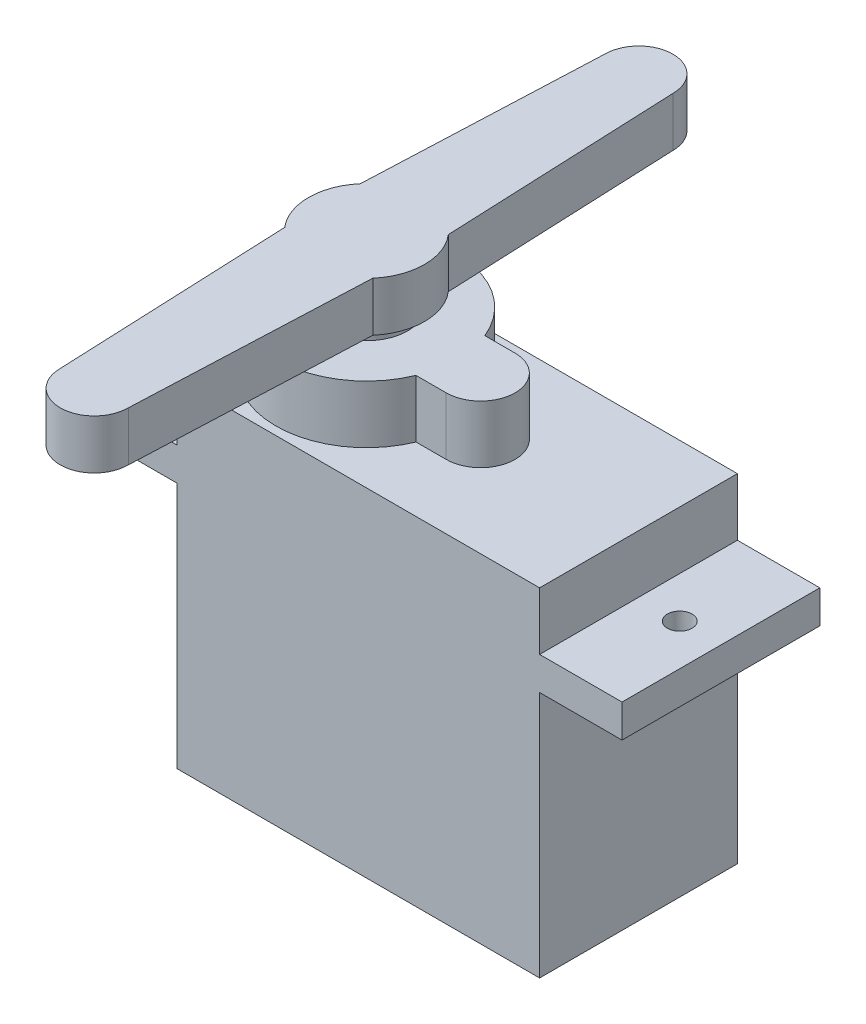
ISO-10303-21;
HEADER;
FILE_DESCRIPTION(('STEP AP214'),'2;1');
FILE_NAME('part.step','',(''),(''),'','','');
FILE_SCHEMA(('AUTOMOTIVE_DESIGN { 1 0 10303 214 1 1 1 1 }'));
ENDSEC;
DATA;
#1=APPLICATION_CONTEXT('core data for automotive mechanical design processes');
#2=APPLICATION_PROTOCOL_DEFINITION('international standard','automotive_design',2000,#1);
#3=PRODUCT_CONTEXT('',#1,'mechanical');
#4=PRODUCT('Part','Part','',(#3));
#5=PRODUCT_RELATED_PRODUCT_CATEGORY('part','',(#4));
#6=PRODUCT_DEFINITION_FORMATION('','',#4);
#7=PRODUCT_DEFINITION_CONTEXT('part definition',#1,'design');
#8=PRODUCT_DEFINITION('design','',#6,#7);
#9=PRODUCT_DEFINITION_SHAPE('','',#8);
#10=(LENGTH_UNIT() NAMED_UNIT(*) SI_UNIT(.MILLI.,.METRE.));
#11=(NAMED_UNIT(*) PLANE_ANGLE_UNIT() SI_UNIT($,.RADIAN.));
#12=(NAMED_UNIT(*) SI_UNIT($,.STERADIAN.) SOLID_ANGLE_UNIT());
#13=UNCERTAINTY_MEASURE_WITH_UNIT(LENGTH_MEASURE(1.E-05),#10,'distance_accuracy_value','');
#14=(GEOMETRIC_REPRESENTATION_CONTEXT(3) GLOBAL_UNCERTAINTY_ASSIGNED_CONTEXT((#13)) GLOBAL_UNIT_ASSIGNED_CONTEXT((#10,
#11,#12)) REPRESENTATION_CONTEXT('',''));
#15=CARTESIAN_POINT('',(0.,0.,0.));
#16=DIRECTION('',(0.,0.,1.));
#17=DIRECTION('',(1.,0.,0.));
#18=AXIS2_PLACEMENT_3D('',#15,#16,#17);
#19=CARTESIAN_POINT('',(-5.5,18.0282679432593,0.0471153363510377));
#20=DIRECTION('',(0.,-1.,0.));
#21=DIRECTION('',(0.,0.,-1.));
#22=AXIS2_PLACEMENT_3D('',#19,#20,#21);
#23=CYLINDRICAL_SURFACE('',#22,2.5);
#24=CARTESIAN_POINT('',(-5.5,15.0282679432593,0.0471153363510377));
#25=DIRECTION('',(0.,1.,0.));
#26=DIRECTION('',(0.,0.,1.));
#27=AXIS2_PLACEMENT_3D('',#24,#25,#26);
#28=CIRCLE('',#27,2.5);
#29=CARTESIAN_POINT('',(-5.5,15.0282679432593,2.54711533635104));
#30=VERTEX_POINT('',#29);
#31=EDGE_CURVE('E88',#30,#30,#28,.T.);
#32=ORIENTED_EDGE('',*,*,#31,.T.);
#33=EDGE_LOOP('',(#32));
#34=FACE_BOUND('',#33,.T.);
#35=CARTESIAN_POINT('',(-5.5,16.0282679432593,0.0471153363510377));
#36=DIRECTION('',(0.,1.,0.));
#37=DIRECTION('',(0.,0.,1.));
#38=AXIS2_PLACEMENT_3D('',#35,#36,#37);
#39=CIRCLE('',#38,2.5);
#40=CARTESIAN_POINT('',(-5.5,16.0282679432593,2.54711533635104));
#41=VERTEX_POINT('',#40);
#42=EDGE_CURVE('E12',#41,#41,#39,.T.);
#43=ORIENTED_EDGE('',*,*,#42,.F.);
#44=EDGE_LOOP('',(#43));
#45=FACE_BOUND('',#44,.T.);
#46=ADVANCED_FACE('F79',(#34,#45),#23,.T.);
#47=CARTESIAN_POINT('',(0.,8.02826794325932,-40.27612723124));
#48=DIRECTION('',(0.,-1.,0.));
#49=DIRECTION('',(0.,0.,-1.));
#50=AXIS2_PLACEMENT_3D('',#47,#48,#49);
#51=PLANE('',#50);
#52=CARTESIAN_POINT('',(-13.5,8.02826794325932,0.0471153363510377));
#53=DIRECTION('',(0.,1.,0.));
#54=DIRECTION('',(0.,0.,1.));
#55=AXIS2_PLACEMENT_3D('',#52,#53,#54);
#56=CIRCLE('',#55,0.75);
#57=CARTESIAN_POINT('',(-13.5,8.02826794325932,0.797115336351038));
#58=VERTEX_POINT('',#57);
#59=EDGE_CURVE('E442',#58,#58,#56,.T.);
#60=ORIENTED_EDGE('',*,*,#59,.F.);
#61=EDGE_LOOP('',(#60));
#62=FACE_BOUND('',#61,.T.);
#63=DIRECTION('',(0.,0.,1.));
#64=VECTOR('',#63,1.);
#65=CARTESIAN_POINT('',(-11.,8.02826794325932,-5.95288466364896));
#66=LINE('',#65,#64);
#67=CARTESIAN_POINT('',(-11.,8.02826794325932,-5.95288466364896));
#68=VERTEX_POINT('',#67);
#69=CARTESIAN_POINT('',(-11.,8.02826794325932,6.04711533635104));
#70=VERTEX_POINT('',#69);
#71=EDGE_CURVE('E354',#68,#70,#66,.T.);
#72=ORIENTED_EDGE('',*,*,#71,.F.);
#73=DIRECTION('',(-1.,0.,0.));
#74=VECTOR('',#73,1.);
#75=CARTESIAN_POINT('',(-11.,8.02826794325932,-5.95288466364896));
#76=LINE('',#75,#74);
#77=CARTESIAN_POINT('',(-16.,8.02826794325932,-5.95288466364896));
#78=VERTEX_POINT('',#77);
#79=EDGE_CURVE('E385',#68,#78,#76,.T.);
#80=ORIENTED_EDGE('',*,*,#79,.T.);
#81=DIRECTION('',(0.,0.,1.));
#82=VECTOR('',#81,1.);
#83=CARTESIAN_POINT('',(-16.,8.02826794325932,-5.95288466364896));
#84=LINE('',#83,#82);
#85=CARTESIAN_POINT('',(-16.,8.02826794325932,6.04711533635104));
#86=VERTEX_POINT('',#85);
#87=EDGE_CURVE('E384',#78,#86,#84,.T.);
#88=ORIENTED_EDGE('',*,*,#87,.T.);
#89=DIRECTION('',(1.,0.,0.));
#90=VECTOR('',#89,1.);
#91=CARTESIAN_POINT('',(-11.,8.02826794325932,6.04711533635104));
#92=LINE('',#91,#90);
#93=EDGE_CURVE('E388',#86,#70,#92,.T.);
#94=ORIENTED_EDGE('',*,*,#93,.T.);
#95=EDGE_LOOP('',(#72,#80,#88,#94));
#96=FACE_BOUND('',#95,.T.);
#97=ADVANCED_FACE('F456',(#62,#96),#51,.F.);
#98=CARTESIAN_POINT('',(13.5,8.02826794325932,0.0471153363510377));
#99=DIRECTION('',(0.,1.,0.));
#100=DIRECTION('',(0.,0.,1.));
#101=AXIS2_PLACEMENT_3D('',#98,#99,#100);
#102=CIRCLE('',#101,0.75);
#103=CARTESIAN_POINT('',(13.5,8.02826794325932,0.797115336351038));
#104=VERTEX_POINT('',#103);
#105=EDGE_CURVE('E274',#104,#104,#102,.T.);
#106=ORIENTED_EDGE('',*,*,#105,.F.);
#107=EDGE_LOOP('',(#106));
#108=FACE_BOUND('',#107,.T.);
#109=DIRECTION('',(0.,0.,-1.));
#110=VECTOR('',#109,1.);
#111=CARTESIAN_POINT('',(11.,8.02826794325932,-5.95288466364896));
#112=LINE('',#111,#110);
#113=CARTESIAN_POINT('',(11.,8.02826794325932,6.04711533635104));
#114=VERTEX_POINT('',#113);
#115=CARTESIAN_POINT('',(11.,8.02826794325932,-5.95288466364896));
#116=VERTEX_POINT('',#115);
#117=EDGE_CURVE('E367',#114,#116,#112,.T.);
#118=ORIENTED_EDGE('',*,*,#117,.F.);
#119=CARTESIAN_POINT('',(16.,8.02826794325932,6.04711533635104));
#120=VERTEX_POINT('',#119);
#121=EDGE_CURVE('E387',#114,#120,#92,.T.);
#122=ORIENTED_EDGE('',*,*,#121,.T.);
#123=DIRECTION('',(0.,0.,-1.));
#124=VECTOR('',#123,1.);
#125=CARTESIAN_POINT('',(16.,8.02826794325932,-5.95288466364896));
#126=LINE('',#125,#124);
#127=CARTESIAN_POINT('',(16.,8.02826794325932,-5.95288466364896));
#128=VERTEX_POINT('',#127);
#129=EDGE_CURVE('E390',#120,#128,#126,.T.);
#130=ORIENTED_EDGE('',*,*,#129,.T.);
#131=EDGE_CURVE('E382',#128,#116,#76,.T.);
#132=ORIENTED_EDGE('',*,*,#131,.T.);
#133=EDGE_LOOP('',(#118,#122,#130,#132));
#134=FACE_BOUND('',#133,.T.);
#135=ADVANCED_FACE('F453',(#108,#134),#51,.F.);
#136=CARTESIAN_POINT('',(-11.,-8.97173205674068,-5.95288466364896));
#137=DIRECTION('',(-1.,0.,0.));
#138=DIRECTION('',(0.,0.,1.));
#139=AXIS2_PLACEMENT_3D('',#136,#137,#138);
#140=PLANE('',#139);
#141=DIRECTION('',(0.,0.,1.));
#142=VECTOR('',#141,1.);
#143=CARTESIAN_POINT('',(-11.,6.02826794325932,-5.95288466364896));
#144=LINE('',#143,#142);
#145=CARTESIAN_POINT('',(-11.,6.02826794325932,-5.95288466364896));
#146=VERTEX_POINT('',#145);
#147=CARTESIAN_POINT('',(-11.,6.02826794325932,6.04711533635104));
#148=VERTEX_POINT('',#147);
#149=EDGE_CURVE('E417',#146,#148,#144,.T.);
#150=ORIENTED_EDGE('',*,*,#149,.F.);
#151=DIRECTION('',(0.,1.,0.));
#152=VECTOR('',#151,1.);
#153=CARTESIAN_POINT('',(-11.,-8.97173205674068,-5.95288466364896));
#154=LINE('',#153,#152);
#155=CARTESIAN_POINT('',(-11.,-8.97173205674068,-5.95288466364896));
#156=VERTEX_POINT('',#155);
#157=EDGE_CURVE('E435',#156,#146,#154,.T.);
#158=ORIENTED_EDGE('',*,*,#157,.F.);
#159=DIRECTION('',(0.,0.,1.));
#160=VECTOR('',#159,1.);
#161=CARTESIAN_POINT('',(-11.,-8.97173205674068,-5.95288466364896));
#162=LINE('',#161,#160);
#163=CARTESIAN_POINT('',(-11.,-8.97173205674068,6.04711533635104));
#164=VERTEX_POINT('',#163);
#165=EDGE_CURVE('E418',#156,#164,#162,.T.);
#166=ORIENTED_EDGE('',*,*,#165,.T.);
#167=DIRECTION('',(0.,1.,0.));
#168=VECTOR('',#167,1.);
#169=CARTESIAN_POINT('',(-11.,-8.97173205674068,6.04711533635104));
#170=LINE('',#169,#168);
#171=EDGE_CURVE('E430',#164,#148,#170,.T.);
#172=ORIENTED_EDGE('',*,*,#171,.T.);
#173=EDGE_LOOP('',(#150,#158,#166,#172));
#174=FACE_BOUND('',#173,.T.);
#175=ADVANCED_FACE('F81',(#174),#140,.T.);
#176=CARTESIAN_POINT('',(-11.,-8.97173205674068,-5.95288466364896));
#177=DIRECTION('',(0.,0.,1.));
#178=DIRECTION('',(1.,0.,0.));
#179=AXIS2_PLACEMENT_3D('',#176,#177,#178);
#180=PLANE('',#179);
#181=ORIENTED_EDGE('',*,*,#157,.T.);
#182=DIRECTION('',(-1.,0.,0.));
#183=VECTOR('',#182,1.);
#184=CARTESIAN_POINT('',(11.,6.02826794325932,-5.95288466364896));
#185=LINE('',#184,#183);
#186=CARTESIAN_POINT('',(-16.,6.02826794325932,-5.95288466364896));
#187=VERTEX_POINT('',#186);
#188=EDGE_CURVE('E402',#146,#187,#185,.T.);
#189=ORIENTED_EDGE('',*,*,#188,.T.);
#190=DIRECTION('',(0.,-1.,0.));
#191=VECTOR('',#190,1.);
#192=CARTESIAN_POINT('',(-16.,8.02826794325932,-5.95288466364896));
#193=LINE('',#192,#191);
#194=EDGE_CURVE('E414',#78,#187,#193,.T.);
#195=ORIENTED_EDGE('',*,*,#194,.F.);
#196=ORIENTED_EDGE('',*,*,#79,.F.);
#197=DIRECTION('',(0.,-1.,0.));
#198=VECTOR('',#197,1.);
#199=CARTESIAN_POINT('',(-11.,11.5282679432593,-5.95288466364896));
#200=LINE('',#199,#198);
#201=CARTESIAN_POINT('',(-11.,11.5282679432593,-5.95288466364896));
#202=VERTEX_POINT('',#201);
#203=EDGE_CURVE('E364',#202,#68,#200,.T.);
#204=ORIENTED_EDGE('',*,*,#203,.F.);
#205=DIRECTION('',(-1.,0.,0.));
#206=VECTOR('',#205,1.);
#207=CARTESIAN_POINT('',(-11.,11.5282679432593,-5.95288466364896));
#208=LINE('',#207,#206);
#209=CARTESIAN_POINT('',(11.,11.5282679432593,-5.95288466364896));
#210=VERTEX_POINT('',#209);
#211=EDGE_CURVE('E362',#210,#202,#208,.T.);
#212=ORIENTED_EDGE('',*,*,#211,.F.);
#213=DIRECTION('',(0.,-1.,0.));
#214=VECTOR('',#213,1.);
#215=CARTESIAN_POINT('',(11.,11.5282679432593,-5.95288466364896));
#216=LINE('',#215,#214);
#217=EDGE_CURVE('E372',#210,#116,#216,.T.);
#218=ORIENTED_EDGE('',*,*,#217,.T.);
#219=ORIENTED_EDGE('',*,*,#131,.F.);
#220=DIRECTION('',(0.,-1.,0.));
#221=VECTOR('',#220,1.);
#222=CARTESIAN_POINT('',(16.,8.02826794325932,-5.95288466364896));
#223=LINE('',#222,#221);
#224=CARTESIAN_POINT('',(16.,6.02826794325932,-5.95288466364896));
#225=VERTEX_POINT('',#224);
#226=EDGE_CURVE('E393',#128,#225,#223,.T.);
#227=ORIENTED_EDGE('',*,*,#226,.T.);
#228=CARTESIAN_POINT('',(11.,6.02826794325932,-5.95288466364896));
#229=VERTEX_POINT('',#228);
#230=EDGE_CURVE('E403',#225,#229,#185,.T.);
#231=ORIENTED_EDGE('',*,*,#230,.T.);
#232=DIRECTION('',(0.,1.,0.));
#233=VECTOR('',#232,1.);
#234=CARTESIAN_POINT('',(11.,-8.97173205674068,-5.95288466364896));
#235=LINE('',#234,#233);
#236=CARTESIAN_POINT('',(11.,-8.97173205674068,-5.95288466364896));
#237=VERTEX_POINT('',#236);
#238=EDGE_CURVE('E437',#237,#229,#235,.T.);
#239=ORIENTED_EDGE('',*,*,#238,.F.);
#240=DIRECTION('',(1.,0.,0.));
#241=VECTOR('',#240,1.);
#242=CARTESIAN_POINT('',(-11.,-8.97173205674068,-5.95288466364896));
#243=LINE('',#242,#241);
#244=EDGE_CURVE('E428',#156,#237,#243,.T.);
#245=ORIENTED_EDGE('',*,*,#244,.F.);
#246=EDGE_LOOP('',(#181,#189,#195,#196,#204,#212,#218,#219,#227,#231,#239,#245));
#247=FACE_BOUND('',#246,.T.);
#248=ADVANCED_FACE('F482',(#247),#180,.F.);
#249=CARTESIAN_POINT('',(11.,-8.97173205674068,6.04711533635104));
#250=DIRECTION('',(1.,0.,0.));
#251=DIRECTION('',(0.,0.,-1.));
#252=AXIS2_PLACEMENT_3D('',#249,#250,#251);
#253=PLANE('',#252);
#254=DIRECTION('',(0.,0.,-1.));
#255=VECTOR('',#254,1.);
#256=CARTESIAN_POINT('',(11.,6.02826794325932,6.04711533635104));
#257=LINE('',#256,#255);
#258=CARTESIAN_POINT('',(11.,6.02826794325932,6.04711533635104));
#259=VERTEX_POINT('',#258);
#260=EDGE_CURVE('E422',#259,#229,#257,.T.);
#261=ORIENTED_EDGE('',*,*,#260,.F.);
#262=DIRECTION('',(0.,1.,0.));
#263=VECTOR('',#262,1.);
#264=CARTESIAN_POINT('',(11.,-8.97173205674068,6.04711533635104));
#265=LINE('',#264,#263);
#266=CARTESIAN_POINT('',(11.,-8.97173205674068,6.04711533635104));
#267=VERTEX_POINT('',#266);
#268=EDGE_CURVE('E439',#267,#259,#265,.T.);
#269=ORIENTED_EDGE('',*,*,#268,.F.);
#270=DIRECTION('',(0.,0.,-1.));
#271=VECTOR('',#270,1.);
#272=CARTESIAN_POINT('',(11.,-8.97173205674068,6.04711533635104));
#273=LINE('',#272,#271);
#274=EDGE_CURVE('E425',#267,#237,#273,.T.);
#275=ORIENTED_EDGE('',*,*,#274,.T.);
#276=ORIENTED_EDGE('',*,*,#238,.T.);
#277=EDGE_LOOP('',(#261,#269,#275,#276));
#278=FACE_BOUND('',#277,.T.);
#279=ADVANCED_FACE('F503',(#278),#253,.T.);
#280=CARTESIAN_POINT('',(-11.,-8.97173205674068,6.04711533635104));
#281=DIRECTION('',(0.,0.,1.));
#282=DIRECTION('',(1.,0.,0.));
#283=AXIS2_PLACEMENT_3D('',#280,#281,#282);
#284=PLANE('',#283);
#285=ORIENTED_EDGE('',*,*,#268,.T.);
#286=DIRECTION('',(1.,0.,0.));
#287=VECTOR('',#286,1.);
#288=CARTESIAN_POINT('',(11.,6.02826794325932,6.04711533635104));
#289=LINE('',#288,#287);
#290=CARTESIAN_POINT('',(16.,6.02826794325932,6.04711533635104));
#291=VERTEX_POINT('',#290);
#292=EDGE_CURVE('E396',#259,#291,#289,.T.);
#293=ORIENTED_EDGE('',*,*,#292,.T.);
#294=DIRECTION('',(0.,-1.,0.));
#295=VECTOR('',#294,1.);
#296=CARTESIAN_POINT('',(16.,8.02826794325932,6.04711533635104));
#297=LINE('',#296,#295);
#298=EDGE_CURVE('E408',#120,#291,#297,.T.);
#299=ORIENTED_EDGE('',*,*,#298,.F.);
#300=ORIENTED_EDGE('',*,*,#121,.F.);
#301=DIRECTION('',(0.,-1.,0.));
#302=VECTOR('',#301,1.);
#303=CARTESIAN_POINT('',(11.,11.5282679432593,6.04711533635104));
#304=LINE('',#303,#302);
#305=CARTESIAN_POINT('',(11.,11.5282679432593,6.04711533635104));
#306=VERTEX_POINT('',#305);
#307=EDGE_CURVE('E375',#306,#114,#304,.T.);
#308=ORIENTED_EDGE('',*,*,#307,.F.);
#309=DIRECTION('',(1.,0.,0.));
#310=VECTOR('',#309,1.);
#311=CARTESIAN_POINT('',(-11.,11.5282679432593,6.04711533635104));
#312=LINE('',#311,#310);
#313=CARTESIAN_POINT('',(-11.,11.5282679432593,6.04711533635104));
#314=VERTEX_POINT('',#313);
#315=EDGE_CURVE('E357',#314,#306,#312,.T.);
#316=ORIENTED_EDGE('',*,*,#315,.F.);
#317=DIRECTION('',(0.,-1.,0.));
#318=VECTOR('',#317,1.);
#319=CARTESIAN_POINT('',(-11.,11.5282679432593,6.04711533635104));
#320=LINE('',#319,#318);
#321=EDGE_CURVE('E378',#314,#70,#320,.T.);
#322=ORIENTED_EDGE('',*,*,#321,.T.);
#323=ORIENTED_EDGE('',*,*,#93,.F.);
#324=DIRECTION('',(0.,-1.,0.));
#325=VECTOR('',#324,1.);
#326=CARTESIAN_POINT('',(-16.,8.02826794325932,6.04711533635104));
#327=LINE('',#326,#325);
#328=CARTESIAN_POINT('',(-16.,6.02826794325932,6.04711533635104));
#329=VERTEX_POINT('',#328);
#330=EDGE_CURVE('E411',#86,#329,#327,.T.);
#331=ORIENTED_EDGE('',*,*,#330,.T.);
#332=EDGE_CURVE('E397',#329,#148,#289,.T.);
#333=ORIENTED_EDGE('',*,*,#332,.T.);
#334=ORIENTED_EDGE('',*,*,#171,.F.);
#335=DIRECTION('',(1.,0.,0.));
#336=VECTOR('',#335,1.);
#337=CARTESIAN_POINT('',(-11.,-8.97173205674068,6.04711533635104));
#338=LINE('',#337,#336);
#339=EDGE_CURVE('E421',#164,#267,#338,.T.);
#340=ORIENTED_EDGE('',*,*,#339,.T.);
#341=EDGE_LOOP('',(#285,#293,#299,#300,#308,#316,#322,#323,#331,#333,#334,#340));
#342=FACE_BOUND('',#341,.T.);
#343=ADVANCED_FACE('F464',(#342),#284,.T.);
#344=CARTESIAN_POINT('',(0.,-8.97173205674068,-40.27612723124));
#345=DIRECTION('',(0.,1.,0.));
#346=DIRECTION('',(0.,0.,1.));
#347=AXIS2_PLACEMENT_3D('',#344,#345,#346);
#348=PLANE('',#347);
#349=ORIENTED_EDGE('',*,*,#165,.F.);
#350=ORIENTED_EDGE('',*,*,#244,.T.);
#351=ORIENTED_EDGE('',*,*,#274,.F.);
#352=ORIENTED_EDGE('',*,*,#339,.F.);
#353=EDGE_LOOP('',(#349,#350,#351,#352));
#354=FACE_BOUND('',#353,.T.);
#355=ADVANCED_FACE('F497',(#354),#348,.F.);
#356=CARTESIAN_POINT('',(0.,6.02826794325932,-40.27612723124));
#357=DIRECTION('',(0.,-1.,0.));
#358=DIRECTION('',(0.,0.,-1.));
#359=AXIS2_PLACEMENT_3D('',#356,#357,#358);
#360=PLANE('',#359);
#361=CARTESIAN_POINT('',(-13.5,6.02826794325932,0.0471153363510377));
#362=DIRECTION('',(0.,-1.,0.));
#363=DIRECTION('',(0.,0.,-1.));
#364=AXIS2_PLACEMENT_3D('',#361,#362,#363);
#365=CIRCLE('',#364,0.75);
#366=CARTESIAN_POINT('',(-13.5,6.02826794325932,-0.702884663648963));
#367=VERTEX_POINT('',#366);
#368=EDGE_CURVE('E83',#367,#367,#365,.T.);
#369=ORIENTED_EDGE('',*,*,#368,.F.);
#370=EDGE_LOOP('',(#369));
#371=FACE_BOUND('',#370,.T.);
#372=ORIENTED_EDGE('',*,*,#188,.F.);
#373=ORIENTED_EDGE('',*,*,#149,.T.);
#374=ORIENTED_EDGE('',*,*,#332,.F.);
#375=DIRECTION('',(0.,0.,1.));
#376=VECTOR('',#375,1.);
#377=CARTESIAN_POINT('',(-16.,6.02826794325932,-5.95288466364896));
#378=LINE('',#377,#376);
#379=EDGE_CURVE('E381',#187,#329,#378,.T.);
#380=ORIENTED_EDGE('',*,*,#379,.F.);
#381=EDGE_LOOP('',(#372,#373,#374,#380));
#382=FACE_BOUND('',#381,.T.);
#383=ADVANCED_FACE('F491',(#371,#382),#360,.T.);
#384=CARTESIAN_POINT('',(-16.,8.02826794325932,-5.95288466364896));
#385=DIRECTION('',(1.,0.,0.));
#386=DIRECTION('',(0.,0.,-1.));
#387=AXIS2_PLACEMENT_3D('',#384,#385,#386);
#388=PLANE('',#387);
#389=ORIENTED_EDGE('',*,*,#379,.T.);
#390=ORIENTED_EDGE('',*,*,#330,.F.);
#391=ORIENTED_EDGE('',*,*,#87,.F.);
#392=ORIENTED_EDGE('',*,*,#194,.T.);
#393=EDGE_LOOP('',(#389,#390,#391,#392));
#394=FACE_BOUND('',#393,.T.);
#395=ADVANCED_FACE('F488',(#394),#388,.F.);
#396=CARTESIAN_POINT('',(16.,8.02826794325932,-5.95288466364896));
#397=DIRECTION('',(-1.,0.,0.));
#398=DIRECTION('',(0.,0.,1.));
#399=AXIS2_PLACEMENT_3D('',#396,#397,#398);
#400=PLANE('',#399);
#401=DIRECTION('',(0.,0.,-1.));
#402=VECTOR('',#401,1.);
#403=CARTESIAN_POINT('',(16.,6.02826794325932,-5.95288466364896));
#404=LINE('',#403,#402);
#405=EDGE_CURVE('E400',#291,#225,#404,.T.);
#406=ORIENTED_EDGE('',*,*,#405,.T.);
#407=ORIENTED_EDGE('',*,*,#226,.F.);
#408=ORIENTED_EDGE('',*,*,#129,.F.);
#409=ORIENTED_EDGE('',*,*,#298,.T.);
#410=EDGE_LOOP('',(#406,#407,#408,#409));
#411=FACE_BOUND('',#410,.T.);
#412=ADVANCED_FACE('F510',(#411),#400,.F.);
#413=CARTESIAN_POINT('',(13.5,6.02826794325932,0.0471153363510377));
#414=DIRECTION('',(0.,-1.,0.));
#415=DIRECTION('',(0.,0.,-1.));
#416=AXIS2_PLACEMENT_3D('',#413,#414,#415);
#417=CIRCLE('',#416,0.75);
#418=CARTESIAN_POINT('',(13.5,6.02826794325932,-0.702884663648963));
#419=VERTEX_POINT('',#418);
#420=EDGE_CURVE('E272',#419,#419,#417,.T.);
#421=ORIENTED_EDGE('',*,*,#420,.F.);
#422=EDGE_LOOP('',(#421));
#423=FACE_BOUND('',#422,.T.);
#424=ORIENTED_EDGE('',*,*,#292,.F.);
#425=ORIENTED_EDGE('',*,*,#260,.T.);
#426=ORIENTED_EDGE('',*,*,#230,.F.);
#427=ORIENTED_EDGE('',*,*,#405,.F.);
#428=EDGE_LOOP('',(#424,#425,#426,#427));
#429=FACE_BOUND('',#428,.T.);
#430=ADVANCED_FACE('F507',(#423,#429),#360,.T.);
#431=CARTESIAN_POINT('',(-11.,11.5282679432593,-5.95288466364896));
#432=DIRECTION('',(1.,0.,0.));
#433=DIRECTION('',(0.,0.,-1.));
#434=AXIS2_PLACEMENT_3D('',#431,#432,#433);
#435=PLANE('',#434);
#436=ORIENTED_EDGE('',*,*,#71,.T.);
#437=ORIENTED_EDGE('',*,*,#321,.F.);
#438=DIRECTION('',(0.,0.,1.));
#439=VECTOR('',#438,1.);
#440=CARTESIAN_POINT('',(-11.,11.5282679432593,-5.95288466364896));
#441=LINE('',#440,#439);
#442=CARTESIAN_POINT('',(-11.,11.5282679432593,0.0471153363510377));
#443=VERTEX_POINT('',#442);
#444=EDGE_CURVE('E358',#443,#314,#441,.T.);
#445=ORIENTED_EDGE('',*,*,#444,.F.);
#446=EDGE_CURVE('E355',#202,#443,#441,.T.);
#447=ORIENTED_EDGE('',*,*,#446,.F.);
#448=ORIENTED_EDGE('',*,*,#203,.T.);
#449=EDGE_LOOP('',(#436,#437,#445,#447,#448));
#450=FACE_BOUND('',#449,.T.);
#451=ADVANCED_FACE('F476',(#450),#435,.F.);
#452=CARTESIAN_POINT('',(11.,11.5282679432593,-5.95288466364896));
#453=DIRECTION('',(-1.,0.,0.));
#454=DIRECTION('',(0.,0.,1.));
#455=AXIS2_PLACEMENT_3D('',#452,#453,#454);
#456=PLANE('',#455);
#457=ORIENTED_EDGE('',*,*,#117,.T.);
#458=ORIENTED_EDGE('',*,*,#217,.F.);
#459=DIRECTION('',(0.,0.,-1.));
#460=VECTOR('',#459,1.);
#461=CARTESIAN_POINT('',(11.,11.5282679432593,-5.95288466364896));
#462=LINE('',#461,#460);
#463=EDGE_CURVE('E360',#306,#210,#462,.T.);
#464=ORIENTED_EDGE('',*,*,#463,.F.);
#465=ORIENTED_EDGE('',*,*,#307,.T.);
#466=EDGE_LOOP('',(#457,#458,#464,#465));
#467=FACE_BOUND('',#466,.T.);
#468=ADVANCED_FACE('F468',(#467),#456,.F.);
#469=CARTESIAN_POINT('',(0.,11.5282679432593,-40.27612723124));
#470=DIRECTION('',(0.,1.,0.));
#471=DIRECTION('',(0.,0.,1.));
#472=AXIS2_PLACEMENT_3D('',#469,#470,#471);
#473=PLANE('',#472);
#474=CARTESIAN_POINT('',(-5.5,11.5282679432593,0.0471153363510377));
#475=DIRECTION('',(0.,1.,0.));
#476=DIRECTION('',(0.,0.,1.));
#477=AXIS2_PLACEMENT_3D('',#474,#475,#476);
#478=CIRCLE('',#477,5.5);
#479=CARTESIAN_POINT('',(-0.411964627670282,11.5282679432593,-2.04139993769451));
#480=VERTEX_POINT('',#479);
#481=EDGE_CURVE('E96',#480,#443,#478,.T.);
#482=ORIENTED_EDGE('',*,*,#481,.F.);
#483=DIRECTION('',(-1.,0.,0.));
#484=VECTOR('',#483,1.);
#485=CARTESIAN_POINT('',(-0.411964627670282,11.5282679432593,-2.04139993769451));
#486=LINE('',#485,#484);
#487=CARTESIAN_POINT('',(1.42355561448682,11.5282679432593,-2.04139993769451));
#488=VERTEX_POINT('',#487);
#489=EDGE_CURVE('E100',#488,#480,#486,.T.);
#490=ORIENTED_EDGE('',*,*,#489,.F.);
#491=CARTESIAN_POINT('',(1.42355561448682,11.5282679432593,0.0471153363510377));
#492=DIRECTION('',(0.,1.,0.));
#493=DIRECTION('',(0.,0.,1.));
#494=AXIS2_PLACEMENT_3D('',#491,#492,#493);
#495=CIRCLE('',#494,2.08851527404555);
#496=CARTESIAN_POINT('',(1.42355561448682,11.5282679432593,2.13563061039659));
#497=VERTEX_POINT('',#496);
#498=EDGE_CURVE('E340',#497,#488,#495,.T.);
#499=ORIENTED_EDGE('',*,*,#498,.F.);
#500=DIRECTION('',(1.,0.,0.));
#501=VECTOR('',#500,1.);
#502=CARTESIAN_POINT('',(-0.411964627670282,11.5282679432593,2.13563061039659));
#503=LINE('',#502,#501);
#504=CARTESIAN_POINT('',(-0.411964627670282,11.5282679432593,2.13563061039659));
#505=VERTEX_POINT('',#504);
#506=EDGE_CURVE('E337',#505,#497,#503,.T.);
#507=ORIENTED_EDGE('',*,*,#506,.F.);
#508=EDGE_CURVE('E325',#443,#505,#478,.T.);
#509=ORIENTED_EDGE('',*,*,#508,.F.);
#510=ORIENTED_EDGE('',*,*,#444,.T.);
#511=ORIENTED_EDGE('',*,*,#315,.T.);
#512=ORIENTED_EDGE('',*,*,#463,.T.);
#513=ORIENTED_EDGE('',*,*,#211,.T.);
#514=ORIENTED_EDGE('',*,*,#446,.T.);
#515=EDGE_LOOP('',(#482,#490,#499,#507,#509,#510,#511,#512,#513,#514));
#516=FACE_BOUND('',#515,.T.);
#517=ADVANCED_FACE('F470',(#516),#473,.T.);
#518=CARTESIAN_POINT('',(-5.5,15.0282679432593,0.0471153363510377));
#519=DIRECTION('',(0.,-1.,0.));
#520=DIRECTION('',(0.,0.,-1.));
#521=AXIS2_PLACEMENT_3D('',#518,#519,#520);
#522=CYLINDRICAL_SURFACE('',#521,5.5);
#523=ORIENTED_EDGE('',*,*,#481,.T.);
#524=ORIENTED_EDGE('',*,*,#508,.T.);
#525=DIRECTION('',(0.,-1.,0.));
#526=VECTOR('',#525,1.);
#527=CARTESIAN_POINT('',(-0.411964627670282,15.0282679432593,2.13563061039659));
#528=LINE('',#527,#526);
#529=CARTESIAN_POINT('',(-0.411964627670282,15.0282679432593,2.13563061039659));
#530=VERTEX_POINT('',#529);
#531=EDGE_CURVE('E351',#530,#505,#528,.T.);
#532=ORIENTED_EDGE('',*,*,#531,.F.);
#533=CARTESIAN_POINT('',(-5.5,15.0282679432593,0.0471153363510377));
#534=DIRECTION('',(0.,1.,0.));
#535=DIRECTION('',(0.,0.,1.));
#536=AXIS2_PLACEMENT_3D('',#533,#534,#535);
#537=CIRCLE('',#536,5.5);
#538=CARTESIAN_POINT('',(-0.411964627670282,15.0282679432593,-2.04139993769451));
#539=VERTEX_POINT('',#538);
#540=EDGE_CURVE('E326',#539,#530,#537,.T.);
#541=ORIENTED_EDGE('',*,*,#540,.F.);
#542=DIRECTION('',(0.,-1.,0.));
#543=VECTOR('',#542,1.);
#544=CARTESIAN_POINT('',(-0.411964627670282,15.0282679432593,-2.04139993769451));
#545=LINE('',#544,#543);
#546=EDGE_CURVE('E335',#539,#480,#545,.T.);
#547=ORIENTED_EDGE('',*,*,#546,.T.);
#548=EDGE_LOOP('',(#523,#524,#532,#541,#547));
#549=FACE_BOUND('',#548,.T.);
#550=ADVANCED_FACE('F548',(#549),#522,.T.);
#551=CARTESIAN_POINT('',(-0.411964627670282,15.0282679432593,2.13563061039659));
#552=DIRECTION('',(0.,0.,-1.));
#553=DIRECTION('',(-1.,0.,0.));
#554=AXIS2_PLACEMENT_3D('',#551,#552,#553);
#555=PLANE('',#554);
#556=ORIENTED_EDGE('',*,*,#506,.T.);
#557=DIRECTION('',(0.,-1.,0.));
#558=VECTOR('',#557,1.);
#559=CARTESIAN_POINT('',(1.42355561448682,15.0282679432593,2.13563061039659));
#560=LINE('',#559,#558);
#561=CARTESIAN_POINT('',(1.42355561448682,15.0282679432593,2.13563061039659));
#562=VERTEX_POINT('',#561);
#563=EDGE_CURVE('E348',#562,#497,#560,.T.);
#564=ORIENTED_EDGE('',*,*,#563,.F.);
#565=DIRECTION('',(1.,0.,0.));
#566=VECTOR('',#565,1.);
#567=CARTESIAN_POINT('',(-0.411964627670282,15.0282679432593,2.13563061039659));
#568=LINE('',#567,#566);
#569=EDGE_CURVE('E329',#530,#562,#568,.T.);
#570=ORIENTED_EDGE('',*,*,#569,.F.);
#571=ORIENTED_EDGE('',*,*,#531,.T.);
#572=EDGE_LOOP('',(#556,#564,#570,#571));
#573=FACE_BOUND('',#572,.T.);
#574=ADVANCED_FACE('F544',(#573),#555,.F.);
#575=CARTESIAN_POINT('',(1.42355561448682,15.0282679432593,0.0471153363510377));
#576=DIRECTION('',(0.,-1.,0.));
#577=DIRECTION('',(0.,0.,-1.));
#578=AXIS2_PLACEMENT_3D('',#575,#576,#577);
#579=CYLINDRICAL_SURFACE('',#578,2.08851527404555);
#580=ORIENTED_EDGE('',*,*,#498,.T.);
#581=DIRECTION('',(0.,-1.,0.));
#582=VECTOR('',#581,1.);
#583=CARTESIAN_POINT('',(1.42355561448682,15.0282679432593,-2.04139993769451));
#584=LINE('',#583,#582);
#585=CARTESIAN_POINT('',(1.42355561448682,15.0282679432593,-2.04139993769451));
#586=VERTEX_POINT('',#585);
#587=EDGE_CURVE('E345',#586,#488,#584,.T.);
#588=ORIENTED_EDGE('',*,*,#587,.F.);
#589=CARTESIAN_POINT('',(1.42355561448682,15.0282679432593,0.0471153363510377));
#590=DIRECTION('',(0.,1.,0.));
#591=DIRECTION('',(0.,0.,1.));
#592=AXIS2_PLACEMENT_3D('',#589,#590,#591);
#593=CIRCLE('',#592,2.08851527404555);
#594=EDGE_CURVE('E331',#562,#586,#593,.T.);
#595=ORIENTED_EDGE('',*,*,#594,.F.);
#596=ORIENTED_EDGE('',*,*,#563,.T.);
#597=EDGE_LOOP('',(#580,#588,#595,#596));
#598=FACE_BOUND('',#597,.T.);
#599=ADVANCED_FACE('F540',(#598),#579,.T.);
#600=CARTESIAN_POINT('',(-0.411964627670282,15.0282679432593,-2.04139993769451));
#601=DIRECTION('',(0.,0.,1.));
#602=DIRECTION('',(1.,0.,0.));
#603=AXIS2_PLACEMENT_3D('',#600,#601,#602);
#604=PLANE('',#603);
#605=ORIENTED_EDGE('',*,*,#489,.T.);
#606=ORIENTED_EDGE('',*,*,#546,.F.);
#607=DIRECTION('',(-1.,0.,0.));
#608=VECTOR('',#607,1.);
#609=CARTESIAN_POINT('',(-0.411964627670282,15.0282679432593,-2.04139993769451));
#610=LINE('',#609,#608);
#611=EDGE_CURVE('E333',#586,#539,#610,.T.);
#612=ORIENTED_EDGE('',*,*,#611,.F.);
#613=ORIENTED_EDGE('',*,*,#587,.T.);
#614=EDGE_LOOP('',(#605,#606,#612,#613));
#615=FACE_BOUND('',#614,.T.);
#616=ADVANCED_FACE('F536',(#615),#604,.F.);
#617=CARTESIAN_POINT('',(-5.5,15.0282679432593,0.0471153363510377));
#618=DIRECTION('',(0.,1.,0.));
#619=DIRECTION('',(0.,0.,1.));
#620=AXIS2_PLACEMENT_3D('',#617,#618,#619);
#621=PLANE('',#620);
#622=ORIENTED_EDGE('',*,*,#31,.F.);
#623=EDGE_LOOP('',(#622));
#624=FACE_BOUND('',#623,.T.);
#625=ORIENTED_EDGE('',*,*,#540,.T.);
#626=ORIENTED_EDGE('',*,*,#569,.T.);
#627=ORIENTED_EDGE('',*,*,#594,.T.);
#628=ORIENTED_EDGE('',*,*,#611,.T.);
#629=EDGE_LOOP('',(#625,#626,#627,#628));
#630=FACE_BOUND('',#629,.T.);
#631=ADVANCED_FACE('F533',(#624,#630),#621,.T.);
#632=CARTESIAN_POINT('',(-5.5,16.0282679432593,0.0471153363510377));
#633=DIRECTION('',(0.,1.,0.));
#634=DIRECTION('',(0.,0.,1.));
#635=AXIS2_PLACEMENT_3D('',#632,#633,#634);
#636=CYLINDRICAL_SURFACE('',#635,3.52);
#637=DIRECTION('',(0.,1.,0.));
#638=VECTOR('',#637,1.);
#639=CARTESIAN_POINT('',(-8.17103476640821,16.0282679432593,2.33970628910267));
#640=LINE('',#639,#638);
#641=CARTESIAN_POINT('',(-8.17103476640821,16.0282679432593,2.33970628910267));
#642=VERTEX_POINT('',#641);
#643=CARTESIAN_POINT('',(-8.17103476640821,19.0282679432593,2.33970628910267));
#644=VERTEX_POINT('',#643);
#645=EDGE_CURVE('E244',#642,#644,#640,.T.);
#646=ORIENTED_EDGE('',*,*,#645,.T.);
#647=CARTESIAN_POINT('',(-5.5,19.0282679432593,0.0471153363510377));
#648=DIRECTION('',(0.,1.,0.));
#649=DIRECTION('',(0.,0.,1.));
#650=AXIS2_PLACEMENT_3D('',#647,#648,#649);
#651=CIRCLE('',#650,3.52);
#652=CARTESIAN_POINT('',(-8.17103476640821,19.0282679432593,-2.24547561640059));
#653=VERTEX_POINT('',#652);
#654=EDGE_CURVE('E248',#653,#644,#651,.T.);
#655=ORIENTED_EDGE('',*,*,#654,.F.);
#656=DIRECTION('',(0.,1.,0.));
#657=VECTOR('',#656,1.);
#658=CARTESIAN_POINT('',(-8.17103476640821,16.0282679432593,-2.24547561640059));
#659=LINE('',#658,#657);
#660=CARTESIAN_POINT('',(-8.17103476640821,16.0282679432593,-2.24547561640059));
#661=VERTEX_POINT('',#660);
#662=EDGE_CURVE('E310',#661,#653,#659,.T.);
#663=ORIENTED_EDGE('',*,*,#662,.F.);
#664=CARTESIAN_POINT('',(-5.5,16.0282679432593,0.0471153363510377));
#665=DIRECTION('',(0.,1.,0.));
#666=DIRECTION('',(0.,0.,1.));
#667=AXIS2_PLACEMENT_3D('',#664,#665,#666);
#668=CIRCLE('',#667,3.52);
#669=EDGE_CURVE('E250',#661,#642,#668,.T.);
#670=ORIENTED_EDGE('',*,*,#669,.T.);
#671=EDGE_LOOP('',(#646,#655,#663,#670));
#672=FACE_BOUND('',#671,.T.);
#673=ADVANCED_FACE('F246',(#672),#636,.T.);
#674=CARTESIAN_POINT('',(-7.56561045412534,16.0282679432593,-16.472884663649));
#675=DIRECTION('',(-0.999095832776536,0.,-0.0425149024291532));
#676=DIRECTION('',(-0.0425149024291532,0.,0.999095832776536));
#677=AXIS2_PLACEMENT_3D('',#674,#675,#676);
#678=PLANE('',#677);
#679=ORIENTED_EDGE('',*,*,#662,.T.);
#680=DIRECTION('',(-0.0425149024291532,0.,0.999095832776536));
#681=VECTOR('',#680,1.);
#682=CARTESIAN_POINT('',(-7.56561045412534,19.0282679432593,-16.472884663649));
#683=LINE('',#682,#681);
#684=CARTESIAN_POINT('',(-7.56561045412534,19.0282679432593,-16.472884663649));
#685=VERTEX_POINT('',#684);
#686=EDGE_CURVE('E269',#685,#653,#683,.T.);
#687=ORIENTED_EDGE('',*,*,#686,.F.);
#688=DIRECTION('',(0.,1.,0.));
#689=VECTOR('',#688,1.);
#690=CARTESIAN_POINT('',(-7.56561045412534,16.0282679432593,-16.472884663649));
#691=LINE('',#690,#689);
#692=CARTESIAN_POINT('',(-7.56561045412534,16.0282679432593,-16.472884663649));
#693=VERTEX_POINT('',#692);
#694=EDGE_CURVE('E312',#693,#685,#691,.T.);
#695=ORIENTED_EDGE('',*,*,#694,.F.);
#696=DIRECTION('',(-0.0425149024291532,0.,0.999095832776536));
#697=VECTOR('',#696,1.);
#698=CARTESIAN_POINT('',(-7.56561045412534,16.0282679432593,-16.472884663649));
#699=LINE('',#698,#697);
#700=EDGE_CURVE('E255',#693,#661,#699,.T.);
#701=ORIENTED_EDGE('',*,*,#700,.T.);
#702=EDGE_LOOP('',(#679,#687,#695,#701));
#703=FACE_BOUND('',#702,.T.);
#704=ADVANCED_FACE('F594',(#703),#678,.T.);
#705=CARTESIAN_POINT('',(-5.5,16.0282679432593,-16.472884663649));
#706=DIRECTION('',(0.,1.,0.));
#707=DIRECTION('',(0.,0.,1.));
#708=AXIS2_PLACEMENT_3D('',#705,#706,#707);
#709=CYLINDRICAL_SURFACE('',#708,2.06561045412534);
#710=ORIENTED_EDGE('',*,*,#694,.T.);
#711=CARTESIAN_POINT('',(-5.5,19.0282679432593,-16.472884663649));
#712=DIRECTION('',(0.,1.,0.));
#713=DIRECTION('',(0.,0.,1.));
#714=AXIS2_PLACEMENT_3D('',#711,#712,#713);
#715=CIRCLE('',#714,2.06561045412534);
#716=CARTESIAN_POINT('',(-3.43438954587466,19.0282679432593,-16.472884663649));
#717=VERTEX_POINT('',#716);
#718=EDGE_CURVE('E287',#717,#685,#715,.T.);
#719=ORIENTED_EDGE('',*,*,#718,.F.);
#720=DIRECTION('',(0.,1.,0.));
#721=VECTOR('',#720,1.);
#722=CARTESIAN_POINT('',(-3.43438954587466,16.0282679432593,-16.472884663649));
#723=LINE('',#722,#721);
#724=CARTESIAN_POINT('',(-3.43438954587466,16.0282679432593,-16.472884663649));
#725=VERTEX_POINT('',#724);
#726=EDGE_CURVE('E314',#725,#717,#723,.T.);
#727=ORIENTED_EDGE('',*,*,#726,.F.);
#728=CARTESIAN_POINT('',(-5.5,16.0282679432593,-16.472884663649));
#729=DIRECTION('',(0.,1.,0.));
#730=DIRECTION('',(0.,0.,1.));
#731=AXIS2_PLACEMENT_3D('',#728,#729,#730);
#732=CIRCLE('',#731,2.06561045412534);
#733=EDGE_CURVE('E305',#725,#693,#732,.T.);
#734=ORIENTED_EDGE('',*,*,#733,.T.);
#735=EDGE_LOOP('',(#710,#719,#727,#734));
#736=FACE_BOUND('',#735,.T.);
#737=ADVANCED_FACE('F600',(#736),#709,.T.);
#738=CARTESIAN_POINT('',(-3.43438954587466,16.0282679432593,-16.472884663649));
#739=DIRECTION('',(0.999095832776536,0.,-0.0425149024291532));
#740=DIRECTION('',(-0.0425149024291532,0.,-0.999095832776536));
#741=AXIS2_PLACEMENT_3D('',#738,#739,#740);
#742=PLANE('',#741);
#743=ORIENTED_EDGE('',*,*,#726,.T.);
#744=DIRECTION('',(-0.0425149024291532,0.,-0.999095832776536));
#745=VECTOR('',#744,1.);
#746=CARTESIAN_POINT('',(-3.43438954587466,19.0282679432593,-16.472884663649));
#747=LINE('',#746,#745);
#748=CARTESIAN_POINT('',(-2.82896523359179,19.0282679432593,-2.24547561640059));
#749=VERTEX_POINT('',#748);
#750=EDGE_CURVE('E284',#749,#717,#747,.T.);
#751=ORIENTED_EDGE('',*,*,#750,.F.);
#752=DIRECTION('',(0.,1.,0.));
#753=VECTOR('',#752,1.);
#754=CARTESIAN_POINT('',(-2.82896523359179,16.0282679432593,-2.24547561640059));
#755=LINE('',#754,#753);
#756=CARTESIAN_POINT('',(-2.82896523359179,16.0282679432593,-2.24547561640059));
#757=VERTEX_POINT('',#756);
#758=EDGE_CURVE('E316',#757,#749,#755,.T.);
#759=ORIENTED_EDGE('',*,*,#758,.F.);
#760=DIRECTION('',(-0.0425149024291532,0.,-0.999095832776536));
#761=VECTOR('',#760,1.);
#762=CARTESIAN_POINT('',(-3.43438954587466,16.0282679432593,-16.472884663649));
#763=LINE('',#762,#761);
#764=EDGE_CURVE('E302',#757,#725,#763,.T.);
#765=ORIENTED_EDGE('',*,*,#764,.T.);
#766=EDGE_LOOP('',(#743,#751,#759,#765));
#767=FACE_BOUND('',#766,.T.);
#768=ADVANCED_FACE('F608',(#767),#742,.T.);
#769=CARTESIAN_POINT('',(-5.5,16.0282679432593,0.0471153363510377));
#770=DIRECTION('',(0.,1.,0.));
#771=DIRECTION('',(0.,0.,1.));
#772=AXIS2_PLACEMENT_3D('',#769,#770,#771);
#773=CYLINDRICAL_SURFACE('',#772,3.52);
#774=ORIENTED_EDGE('',*,*,#758,.T.);
#775=CARTESIAN_POINT('',(-5.5,19.0282679432593,0.0471153363510377));
#776=DIRECTION('',(0.,1.,0.));
#777=DIRECTION('',(0.,0.,1.));
#778=AXIS2_PLACEMENT_3D('',#775,#776,#777);
#779=CIRCLE('',#778,3.52);
#780=CARTESIAN_POINT('',(-2.82896523359179,19.0282679432593,2.33970628910267));
#781=VERTEX_POINT('',#780);
#782=EDGE_CURVE('E281',#781,#749,#779,.T.);
#783=ORIENTED_EDGE('',*,*,#782,.F.);
#784=DIRECTION('',(0.,1.,0.));
#785=VECTOR('',#784,1.);
#786=CARTESIAN_POINT('',(-2.82896523359179,16.0282679432593,2.33970628910267));
#787=LINE('',#786,#785);
#788=CARTESIAN_POINT('',(-2.82896523359179,16.0282679432593,2.33970628910267));
#789=VERTEX_POINT('',#788);
#790=EDGE_CURVE('E318',#789,#781,#787,.T.);
#791=ORIENTED_EDGE('',*,*,#790,.F.);
#792=CARTESIAN_POINT('',(-5.5,16.0282679432593,0.0471153363510377));
#793=DIRECTION('',(0.,1.,0.));
#794=DIRECTION('',(0.,0.,1.));
#795=AXIS2_PLACEMENT_3D('',#792,#793,#794);
#796=CIRCLE('',#795,3.52);
#797=EDGE_CURVE('E299',#789,#757,#796,.T.);
#798=ORIENTED_EDGE('',*,*,#797,.T.);
#799=EDGE_LOOP('',(#774,#783,#791,#798));
#800=FACE_BOUND('',#799,.T.);
#801=ADVANCED_FACE('F616',(#800),#773,.T.);
#802=CARTESIAN_POINT('',(-3.43438954587466,16.0282679432593,16.567115336351));
#803=DIRECTION('',(0.999095832776536,0.,0.0425149024291532));
#804=DIRECTION('',(0.0425149024291532,0.,-0.999095832776536));
#805=AXIS2_PLACEMENT_3D('',#802,#803,#804);
#806=PLANE('',#805);
#807=ORIENTED_EDGE('',*,*,#790,.T.);
#808=DIRECTION('',(0.0425149024291532,0.,-0.999095832776536));
#809=VECTOR('',#808,1.);
#810=CARTESIAN_POINT('',(-3.43438954587466,19.0282679432593,16.567115336351));
#811=LINE('',#810,#809);
#812=CARTESIAN_POINT('',(-3.43438954587466,19.0282679432593,16.567115336351));
#813=VERTEX_POINT('',#812);
#814=EDGE_CURVE('E278',#813,#781,#811,.T.);
#815=ORIENTED_EDGE('',*,*,#814,.F.);
#816=DIRECTION('',(0.,1.,0.));
#817=VECTOR('',#816,1.);
#818=CARTESIAN_POINT('',(-3.43438954587466,16.0282679432593,16.567115336351));
#819=LINE('',#818,#817);
#820=CARTESIAN_POINT('',(-3.43438954587466,16.0282679432593,16.567115336351));
#821=VERTEX_POINT('',#820);
#822=EDGE_CURVE('E320',#821,#813,#819,.T.);
#823=ORIENTED_EDGE('',*,*,#822,.F.);
#824=DIRECTION('',(0.0425149024291532,0.,-0.999095832776536));
#825=VECTOR('',#824,1.);
#826=CARTESIAN_POINT('',(-3.43438954587466,16.0282679432593,16.567115336351));
#827=LINE('',#826,#825);
#828=EDGE_CURVE('E296',#821,#789,#827,.T.);
#829=ORIENTED_EDGE('',*,*,#828,.T.);
#830=EDGE_LOOP('',(#807,#815,#823,#829));
#831=FACE_BOUND('',#830,.T.);
#832=ADVANCED_FACE('F624',(#831),#806,.T.);
#833=CARTESIAN_POINT('',(-5.5,16.0282679432593,16.567115336351));
#834=DIRECTION('',(0.,1.,0.));
#835=DIRECTION('',(0.,0.,1.));
#836=AXIS2_PLACEMENT_3D('',#833,#834,#835);
#837=CYLINDRICAL_SURFACE('',#836,2.06561045412534);
#838=ORIENTED_EDGE('',*,*,#822,.T.);
#839=CARTESIAN_POINT('',(-5.5,19.0282679432593,16.567115336351));
#840=DIRECTION('',(0.,1.,0.));
#841=DIRECTION('',(0.,0.,-1.));
#842=AXIS2_PLACEMENT_3D('',#839,#840,#841);
#843=CIRCLE('',#842,2.06561045412534);
#844=CARTESIAN_POINT('',(-7.56561045412534,19.0282679432593,16.567115336351));
#845=VERTEX_POINT('',#844);
#846=EDGE_CURVE('E263',#845,#813,#843,.T.);
#847=ORIENTED_EDGE('',*,*,#846,.F.);
#848=DIRECTION('',(0.,1.,0.));
#849=VECTOR('',#848,1.);
#850=CARTESIAN_POINT('',(-7.56561045412534,16.0282679432593,16.567115336351));
#851=LINE('',#850,#849);
#852=CARTESIAN_POINT('',(-7.56561045412534,16.0282679432593,16.567115336351));
#853=VERTEX_POINT('',#852);
#854=EDGE_CURVE('E254',#853,#845,#851,.T.);
#855=ORIENTED_EDGE('',*,*,#854,.F.);
#856=CARTESIAN_POINT('',(-5.5,16.0282679432593,16.567115336351));
#857=DIRECTION('',(0.,1.,0.));
#858=DIRECTION('',(0.,0.,-1.));
#859=AXIS2_PLACEMENT_3D('',#856,#857,#858);
#860=CIRCLE('',#859,2.06561045412534);
#861=EDGE_CURVE('E293',#853,#821,#860,.T.);
#862=ORIENTED_EDGE('',*,*,#861,.T.);
#863=EDGE_LOOP('',(#838,#847,#855,#862));
#864=FACE_BOUND('',#863,.T.);
#865=ADVANCED_FACE('F632',(#864),#837,.T.);
#866=CARTESIAN_POINT('',(-7.56561045412534,16.0282679432593,16.567115336351));
#867=DIRECTION('',(-0.999095832776536,0.,0.0425149024291532));
#868=DIRECTION('',(0.0425149024291532,0.,0.999095832776536));
#869=AXIS2_PLACEMENT_3D('',#866,#867,#868);
#870=PLANE('',#869);
#871=ORIENTED_EDGE('',*,*,#854,.T.);
#872=DIRECTION('',(0.0425149024291532,0.,0.999095832776536));
#873=VECTOR('',#872,1.);
#874=CARTESIAN_POINT('',(-7.56561045412534,19.0282679432593,16.567115336351));
#875=LINE('',#874,#873);
#876=EDGE_CURVE('E258',#644,#845,#875,.T.);
#877=ORIENTED_EDGE('',*,*,#876,.F.);
#878=ORIENTED_EDGE('',*,*,#645,.F.);
#879=DIRECTION('',(0.0425149024291532,0.,0.999095832776536));
#880=VECTOR('',#879,1.);
#881=CARTESIAN_POINT('',(-7.56561045412534,16.0282679432593,16.567115336351));
#882=LINE('',#881,#880);
#883=EDGE_CURVE('E291',#642,#853,#882,.T.);
#884=ORIENTED_EDGE('',*,*,#883,.T.);
#885=EDGE_LOOP('',(#871,#877,#878,#884));
#886=FACE_BOUND('',#885,.T.);
#887=ADVANCED_FACE('F259',(#886),#870,.T.);
#888=CARTESIAN_POINT('',(-5.5,16.0282679432593,0.0471153363510377));
#889=DIRECTION('',(0.,1.,0.));
#890=DIRECTION('',(0.,0.,1.));
#891=AXIS2_PLACEMENT_3D('',#888,#889,#890);
#892=PLANE('',#891);
#893=ORIENTED_EDGE('',*,*,#42,.T.);
#894=EDGE_LOOP('',(#893));
#895=FACE_BOUND('',#894,.T.);
#896=ORIENTED_EDGE('',*,*,#669,.F.);
#897=ORIENTED_EDGE('',*,*,#700,.F.);
#898=ORIENTED_EDGE('',*,*,#733,.F.);
#899=ORIENTED_EDGE('',*,*,#764,.F.);
#900=ORIENTED_EDGE('',*,*,#797,.F.);
#901=ORIENTED_EDGE('',*,*,#828,.F.);
#902=ORIENTED_EDGE('',*,*,#861,.F.);
#903=ORIENTED_EDGE('',*,*,#883,.F.);
#904=EDGE_LOOP('',(#896,#897,#898,#899,#900,#901,#902,#903));
#905=FACE_BOUND('',#904,.T.);
#906=ADVANCED_FACE('F647',(#895,#905),#892,.F.);
#907=CARTESIAN_POINT('',(-5.5,19.0282679432593,0.0471153363510377));
#908=DIRECTION('',(0.,1.,0.));
#909=DIRECTION('',(0.,0.,1.));
#910=AXIS2_PLACEMENT_3D('',#907,#908,#909);
#911=PLANE('',#910);
#912=ORIENTED_EDGE('',*,*,#654,.T.);
#913=ORIENTED_EDGE('',*,*,#876,.T.);
#914=ORIENTED_EDGE('',*,*,#846,.T.);
#915=ORIENTED_EDGE('',*,*,#814,.T.);
#916=ORIENTED_EDGE('',*,*,#782,.T.);
#917=ORIENTED_EDGE('',*,*,#750,.T.);
#918=ORIENTED_EDGE('',*,*,#718,.T.);
#919=ORIENTED_EDGE('',*,*,#686,.T.);
#920=EDGE_LOOP('',(#912,#913,#914,#915,#916,#917,#918,#919));
#921=FACE_BOUND('',#920,.T.);
#922=ADVANCED_FACE('F266',(#921),#911,.T.);
#923=CARTESIAN_POINT('',(13.5,-0.971732056740683,0.0471153363510377));
#924=DIRECTION('',(0.,1.,0.));
#925=DIRECTION('',(0.,0.,1.));
#926=AXIS2_PLACEMENT_3D('',#923,#924,#925);
#927=CYLINDRICAL_SURFACE('',#926,0.75);
#928=ORIENTED_EDGE('',*,*,#420,.T.);
#929=EDGE_LOOP('',(#928));
#930=FACE_BOUND('',#929,.T.);
#931=ORIENTED_EDGE('',*,*,#105,.T.);
#932=EDGE_LOOP('',(#931));
#933=FACE_BOUND('',#932,.T.);
#934=ADVANCED_FACE('F451',(#930,#933),#927,.F.);
#935=CARTESIAN_POINT('',(-13.5,-0.971732056740683,0.0471153363510377));
#936=DIRECTION('',(0.,1.,0.));
#937=DIRECTION('',(0.,0.,1.));
#938=AXIS2_PLACEMENT_3D('',#935,#936,#937);
#939=CYLINDRICAL_SURFACE('',#938,0.75);
#940=ORIENTED_EDGE('',*,*,#368,.T.);
#941=EDGE_LOOP('',(#940));
#942=FACE_BOUND('',#941,.T.);
#943=ORIENTED_EDGE('',*,*,#59,.T.);
#944=EDGE_LOOP('',(#943));
#945=FACE_BOUND('',#944,.T.);
#946=ADVANCED_FACE('F685',(#942,#945),#939,.F.);
#947=CLOSED_SHELL('',(#46,#97,#135,#175,#248,#279,#343,#355,#383,#395,#412,#430,#451,#468,#517,
#550,#574,#599,#616,#631,#673,#704,#737,#768,#801,#832,#865,#887,#906,#922,#934,#946));
#948=MANIFOLD_SOLID_BREP('B2',#947);
#949=ADVANCED_BREP_SHAPE_REPRESENTATION('',(#18,#948),#14);
#950=SHAPE_DEFINITION_REPRESENTATION(#9,#949);
ENDSEC;
END-ISO-10303-21;
